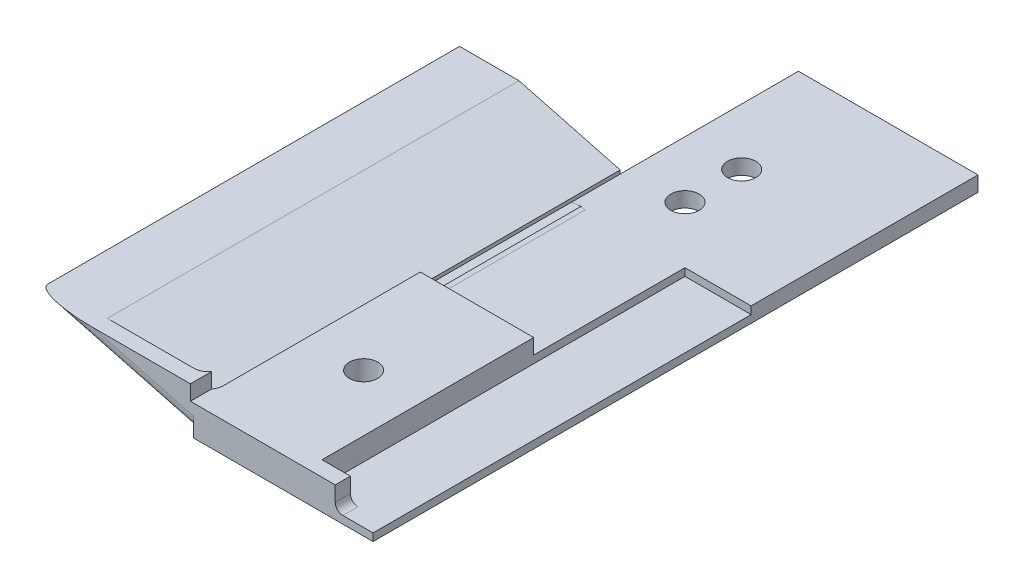
ISO-10303-21;
HEADER;
FILE_DESCRIPTION(('STEP AP214'),'2;1');
FILE_NAME('part.step','',(''),(''),'','','');
FILE_SCHEMA(('AUTOMOTIVE_DESIGN { 1 0 10303 214 1 1 1 1 }'));
ENDSEC;
DATA;
#1=APPLICATION_CONTEXT('core data for automotive mechanical design processes');
#2=APPLICATION_PROTOCOL_DEFINITION('international standard','automotive_design',2000,#1);
#3=PRODUCT_CONTEXT('',#1,'mechanical');
#4=PRODUCT('Part','Part','',(#3));
#5=PRODUCT_RELATED_PRODUCT_CATEGORY('part','',(#4));
#6=PRODUCT_DEFINITION_FORMATION('','',#4);
#7=PRODUCT_DEFINITION_CONTEXT('part definition',#1,'design');
#8=PRODUCT_DEFINITION('design','',#6,#7);
#9=PRODUCT_DEFINITION_SHAPE('','',#8);
#10=(LENGTH_UNIT() NAMED_UNIT(*) SI_UNIT(.MILLI.,.METRE.));
#11=(NAMED_UNIT(*) PLANE_ANGLE_UNIT() SI_UNIT($,.RADIAN.));
#12=(NAMED_UNIT(*) SI_UNIT($,.STERADIAN.) SOLID_ANGLE_UNIT());
#13=UNCERTAINTY_MEASURE_WITH_UNIT(LENGTH_MEASURE(1.E-05),#10,'distance_accuracy_value','');
#14=(GEOMETRIC_REPRESENTATION_CONTEXT(3) GLOBAL_UNCERTAINTY_ASSIGNED_CONTEXT((#13)) GLOBAL_UNIT_ASSIGNED_CONTEXT((#10,
#11,#12)) REPRESENTATION_CONTEXT('',''));
#15=CARTESIAN_POINT('',(0.,0.,0.));
#16=DIRECTION('',(0.,0.,1.));
#17=DIRECTION('',(1.,0.,0.));
#18=AXIS2_PLACEMENT_3D('',#15,#16,#17);
#19=CARTESIAN_POINT('',(-11.1125,5.08,0.));
#20=DIRECTION('',(-1.,0.,0.));
#21=DIRECTION('',(0.,0.,1.));
#22=AXIS2_PLACEMENT_3D('',#19,#20,#21);
#23=PLANE('',#22);
#24=DIRECTION('',(0.,0.,-1.));
#25=VECTOR('',#24,1.);
#26=CARTESIAN_POINT('',(-11.1125,5.08,0.));
#27=LINE('',#26,#25);
#28=CARTESIAN_POINT('',(-11.1125,5.08,48.26));
#29=VERTEX_POINT('',#28);
#30=CARTESIAN_POINT('',(-11.1125,5.08,12.7));
#31=VERTEX_POINT('',#30);
#32=EDGE_CURVE('E564',#29,#31,#27,.T.);
#33=ORIENTED_EDGE('',*,*,#32,.F.);
#34=DIRECTION('',(0.,1.,0.));
#35=VECTOR('',#34,1.);
#36=CARTESIAN_POINT('',(-11.1125,1.27,48.26));
#37=LINE('',#36,#35);
#38=CARTESIAN_POINT('',(-11.1125,1.27,48.26));
#39=VERTEX_POINT('',#38);
#40=EDGE_CURVE('E393',#39,#29,#37,.T.);
#41=ORIENTED_EDGE('',*,*,#40,.F.);
#42=DIRECTION('',(0.,0.,1.));
#43=VECTOR('',#42,1.);
#44=CARTESIAN_POINT('',(-11.1125,1.27,0.));
#45=LINE('',#44,#43);
#46=CARTESIAN_POINT('',(-11.1125,1.27,-12.7));
#47=VERTEX_POINT('',#46);
#48=EDGE_CURVE('E382',#47,#39,#45,.T.);
#49=ORIENTED_EDGE('',*,*,#48,.F.);
#50=DIRECTION('',(0.,1.,0.));
#51=VECTOR('',#50,1.);
#52=CARTESIAN_POINT('',(-11.1125,1.27,-12.7));
#53=LINE('',#52,#51);
#54=CARTESIAN_POINT('',(-11.1125,2.54,-12.7));
#55=VERTEX_POINT('',#54);
#56=EDGE_CURVE('E397',#47,#55,#53,.T.);
#57=ORIENTED_EDGE('',*,*,#56,.T.);
#58=DIRECTION('',(0.,0.,1.));
#59=VECTOR('',#58,1.);
#60=CARTESIAN_POINT('',(-11.1125,2.54,0.));
#61=LINE('',#60,#59);
#62=CARTESIAN_POINT('',(-11.1125,2.54,12.7));
#63=VERTEX_POINT('',#62);
#64=EDGE_CURVE('E381',#55,#63,#61,.T.);
#65=ORIENTED_EDGE('',*,*,#64,.T.);
#66=DIRECTION('',(0.,-1.,0.));
#67=VECTOR('',#66,1.);
#68=CARTESIAN_POINT('',(-11.1125,5.08,12.7));
#69=LINE('',#68,#67);
#70=EDGE_CURVE('E571',#31,#63,#69,.T.);
#71=ORIENTED_EDGE('',*,*,#70,.F.);
#72=EDGE_LOOP('',(#33,#41,#49,#57,#65,#71));
#73=FACE_BOUND('',#72,.T.);
#74=ADVANCED_FACE('F161',(#73),#23,.F.);
#75=CARTESIAN_POINT('',(0.,2.54,0.));
#76=DIRECTION('',(0.,-1.,0.));
#77=DIRECTION('',(0.,0.,-1.));
#78=AXIS2_PLACEMENT_3D('',#75,#76,#77);
#79=PLANE('',#78);
#80=CARTESIAN_POINT('',(-20.6375,2.54,-31.75));
#81=DIRECTION('',(0.,-1.,0.));
#82=DIRECTION('',(0.,0.,-1.));
#83=AXIS2_PLACEMENT_3D('',#80,#81,#82);
#84=CIRCLE('',#83,2.38125);
#85=CARTESIAN_POINT('',(-20.6375,2.54,-34.13125));
#86=VERTEX_POINT('',#85);
#87=EDGE_CURVE('E419',#86,#86,#84,.T.);
#88=ORIENTED_EDGE('',*,*,#87,.T.);
#89=EDGE_LOOP('',(#88));
#90=FACE_BOUND('',#89,.T.);
#91=CARTESIAN_POINT('',(-20.6375,2.54,-22.225));
#92=DIRECTION('',(0.,-1.,0.));
#93=DIRECTION('',(0.,0.,-1.));
#94=AXIS2_PLACEMENT_3D('',#91,#92,#93);
#95=CIRCLE('',#94,2.38125);
#96=CARTESIAN_POINT('',(-20.6375,2.54,-24.60625));
#97=VERTEX_POINT('',#96);
#98=EDGE_CURVE('E422',#97,#97,#95,.T.);
#99=ORIENTED_EDGE('',*,*,#98,.T.);
#100=EDGE_LOOP('',(#99));
#101=FACE_BOUND('',#100,.T.);
#102=DIRECTION('',(1.,0.,0.));
#103=VECTOR('',#102,1.);
#104=CARTESIAN_POINT('',(0.,2.54,12.7));
#105=LINE('',#104,#103);
#106=CARTESIAN_POINT('',(-27.8751566184035,2.54,12.7));
#107=VERTEX_POINT('',#106);
#108=EDGE_CURVE('E566',#107,#63,#105,.T.);
#109=ORIENTED_EDGE('',*,*,#108,.T.);
#110=ORIENTED_EDGE('',*,*,#64,.F.);
#111=DIRECTION('',(1.,0.,0.));
#112=VECTOR('',#111,1.);
#113=CARTESIAN_POINT('',(0.,2.54,-12.7));
#114=LINE('',#113,#112);
#115=CARTESIAN_POINT('',(0.,2.54,-12.7));
#116=VERTEX_POINT('',#115);
#117=EDGE_CURVE('E386',#55,#116,#114,.T.);
#118=ORIENTED_EDGE('',*,*,#117,.T.);
#119=DIRECTION('',(0.,0.,-1.));
#120=VECTOR('',#119,1.);
#121=CARTESIAN_POINT('',(0.,2.54,0.));
#122=LINE('',#121,#120);
#123=CARTESIAN_POINT('',(0.,2.54,-50.8));
#124=VERTEX_POINT('',#123);
#125=EDGE_CURVE('E406',#116,#124,#122,.T.);
#126=ORIENTED_EDGE('',*,*,#125,.T.);
#127=DIRECTION('',(-1.,0.,0.));
#128=VECTOR('',#127,1.);
#129=CARTESIAN_POINT('',(-30.1625,2.54,-50.8));
#130=LINE('',#129,#128);
#131=CARTESIAN_POINT('',(-30.1625,2.54,-50.8));
#132=VERTEX_POINT('',#131);
#133=EDGE_CURVE('E466',#124,#132,#130,.T.);
#134=ORIENTED_EDGE('',*,*,#133,.T.);
#135=DIRECTION('',(0.,0.,1.));
#136=VECTOR('',#135,1.);
#137=CARTESIAN_POINT('',(-30.1625,2.54,0.));
#138=LINE('',#137,#136);
#139=CARTESIAN_POINT('',(-30.1625,2.54,-20.8769227387817));
#140=VERTEX_POINT('',#139);
#141=EDGE_CURVE('E414',#132,#140,#138,.T.);
#142=ORIENTED_EDGE('',*,*,#141,.T.);
#143=CARTESIAN_POINT('',(-30.1625,2.54,-12.7));
#144=VERTEX_POINT('',#143);
#145=EDGE_CURVE('E413',#140,#144,#138,.T.);
#146=ORIENTED_EDGE('',*,*,#145,.T.);
#147=DIRECTION('',(1.,0.,0.));
#148=VECTOR('',#147,1.);
#149=CARTESIAN_POINT('',(0.,2.54,-12.7));
#150=LINE('',#149,#148);
#151=CARTESIAN_POINT('',(-27.8751566184035,2.54,-12.7));
#152=VERTEX_POINT('',#151);
#153=EDGE_CURVE('E410',#144,#152,#150,.T.);
#154=ORIENTED_EDGE('',*,*,#153,.T.);
#155=DIRECTION('',(0.,0.,-1.));
#156=VECTOR('',#155,1.);
#157=CARTESIAN_POINT('',(-27.8751566184035,2.54,0.));
#158=LINE('',#157,#156);
#159=EDGE_CURVE('E624',#107,#152,#158,.T.);
#160=ORIENTED_EDGE('',*,*,#159,.F.);
#161=EDGE_LOOP('',(#109,#110,#118,#126,#134,#142,#146,#154,#160));
#162=FACE_BOUND('',#161,.T.);
#163=ADVANCED_FACE('F581',(#90,#101,#162),#79,.F.);
#164=CARTESIAN_POINT('',(0.,7.62002500000001,-50.8));
#165=DIRECTION('',(-1.,0.,0.));
#166=DIRECTION('',(0.,0.,1.));
#167=AXIS2_PLACEMENT_3D('',#164,#165,#166);
#168=PLANE('',#167);
#169=DIRECTION('',(0.,0.,-1.));
#170=VECTOR('',#169,1.);
#171=CARTESIAN_POINT('',(0.,1.27,0.));
#172=LINE('',#171,#170);
#173=CARTESIAN_POINT('',(0.,1.27,50.8));
#174=VERTEX_POINT('',#173);
#175=CARTESIAN_POINT('',(0.,1.27,-12.7));
#176=VERTEX_POINT('',#175);
#177=EDGE_CURVE('E388',#174,#176,#172,.T.);
#178=ORIENTED_EDGE('',*,*,#177,.F.);
#179=DIRECTION('',(0.,-1.,0.));
#180=VECTOR('',#179,1.);
#181=CARTESIAN_POINT('',(0.,7.62002500000001,50.8));
#182=LINE('',#181,#180);
#183=CARTESIAN_POINT('',(0.,0.,50.8));
#184=VERTEX_POINT('',#183);
#185=EDGE_CURVE('E179',#174,#184,#182,.T.);
#186=ORIENTED_EDGE('',*,*,#185,.T.);
#187=DIRECTION('',(0.,0.,-1.));
#188=VECTOR('',#187,1.);
#189=CARTESIAN_POINT('',(0.,0.,-50.8));
#190=LINE('',#189,#188);
#191=CARTESIAN_POINT('',(0.,0.,-50.8));
#192=VERTEX_POINT('',#191);
#193=EDGE_CURVE('E399',#184,#192,#190,.T.);
#194=ORIENTED_EDGE('',*,*,#193,.T.);
#195=DIRECTION('',(0.,-1.,0.));
#196=VECTOR('',#195,1.);
#197=CARTESIAN_POINT('',(0.,7.62002500000001,-50.8));
#198=LINE('',#197,#196);
#199=EDGE_CURVE('E404',#124,#192,#198,.T.);
#200=ORIENTED_EDGE('',*,*,#199,.F.);
#201=ORIENTED_EDGE('',*,*,#125,.F.);
#202=DIRECTION('',(0.,1.,0.));
#203=VECTOR('',#202,1.);
#204=CARTESIAN_POINT('',(0.,1.27,-12.7));
#205=LINE('',#204,#203);
#206=EDGE_CURVE('E400',#176,#116,#205,.T.);
#207=ORIENTED_EDGE('',*,*,#206,.F.);
#208=EDGE_LOOP('',(#178,#186,#194,#200,#201,#207));
#209=FACE_BOUND('',#208,.T.);
#210=ADVANCED_FACE('F672',(#209),#168,.F.);
#211=CARTESIAN_POINT('',(-30.1625,2.54,50.8));
#212=DIRECTION('',(1.,0.,0.));
#213=DIRECTION('',(0.,0.,-1.));
#214=AXIS2_PLACEMENT_3D('',#211,#212,#213);
#215=PLANE('',#214);
#216=DIRECTION('',(0.,0.,1.));
#217=VECTOR('',#216,1.);
#218=CARTESIAN_POINT('',(-30.1625,3.14213795431633,-20.8769227387817));
#219=LINE('',#218,#217);
#220=CARTESIAN_POINT('',(-30.1625,3.14213795431633,12.7));
#221=VERTEX_POINT('',#220);
#222=CARTESIAN_POINT('',(-30.1625,3.14213795431633,45.72));
#223=VERTEX_POINT('',#222);
#224=EDGE_CURVE('E555',#221,#223,#219,.T.);
#225=ORIENTED_EDGE('',*,*,#224,.T.);
#226=DIRECTION('',(0.,1.,0.));
#227=VECTOR('',#226,1.);
#228=CARTESIAN_POINT('',(-30.1625,5.08,45.72));
#229=LINE('',#228,#227);
#230=CARTESIAN_POINT('',(-30.1625,5.08,45.72));
#231=VERTEX_POINT('',#230);
#232=EDGE_CURVE('E485',#223,#231,#229,.T.);
#233=ORIENTED_EDGE('',*,*,#232,.T.);
#234=DIRECTION('',(0.,0.,1.));
#235=VECTOR('',#234,1.);
#236=CARTESIAN_POINT('',(-30.1625,5.08,0.));
#237=LINE('',#236,#235);
#238=CARTESIAN_POINT('',(-30.1625,5.08,12.7));
#239=VERTEX_POINT('',#238);
#240=EDGE_CURVE('E553',#239,#231,#237,.T.);
#241=ORIENTED_EDGE('',*,*,#240,.F.);
#242=DIRECTION('',(0.,-1.,0.));
#243=VECTOR('',#242,1.);
#244=CARTESIAN_POINT('',(-30.1625,5.08,12.7));
#245=LINE('',#244,#243);
#246=EDGE_CURVE('E577',#239,#221,#245,.T.);
#247=ORIENTED_EDGE('',*,*,#246,.T.);
#248=EDGE_LOOP('',(#225,#233,#241,#247));
#249=FACE_BOUND('',#248,.T.);
#250=ADVANCED_FACE('F551',(#249),#215,.F.);
#251=DIRECTION('',(0.,-1.,0.));
#252=VECTOR('',#251,1.);
#253=CARTESIAN_POINT('',(-30.1625,0.,-20.8769227387817));
#254=LINE('',#253,#252);
#255=CARTESIAN_POINT('',(-30.1625,0.515601870336834,-20.8769227387817));
#256=VERTEX_POINT('',#255);
#257=EDGE_CURVE('E511',#140,#256,#254,.T.);
#258=ORIENTED_EDGE('',*,*,#257,.F.);
#259=ORIENTED_EDGE('',*,*,#141,.F.);
#260=DIRECTION('',(0.,-1.,0.));
#261=VECTOR('',#260,1.);
#262=CARTESIAN_POINT('',(-30.1625,2.54,-50.8));
#263=LINE('',#262,#261);
#264=CARTESIAN_POINT('',(-30.1625,0.,-50.8));
#265=VERTEX_POINT('',#264);
#266=EDGE_CURVE('E467',#132,#265,#263,.T.);
#267=ORIENTED_EDGE('',*,*,#266,.T.);
#268=DIRECTION('',(0.,0.,1.));
#269=VECTOR('',#268,1.);
#270=CARTESIAN_POINT('',(-30.1625,0.,50.8));
#271=LINE('',#270,#269);
#272=CARTESIAN_POINT('',(-30.1625,0.,50.8));
#273=VERTEX_POINT('',#272);
#274=EDGE_CURVE('E453',#265,#273,#271,.T.);
#275=ORIENTED_EDGE('',*,*,#274,.T.);
#276=DIRECTION('',(0.,-1.,0.));
#277=VECTOR('',#276,1.);
#278=CARTESIAN_POINT('',(-30.1625,2.54,50.8));
#279=LINE('',#278,#277);
#280=CARTESIAN_POINT('',(-30.1625,3.14213795431633,50.8));
#281=VERTEX_POINT('',#280);
#282=EDGE_CURVE('E532',#281,#273,#279,.T.);
#283=ORIENTED_EDGE('',*,*,#282,.F.);
#284=CARTESIAN_POINT('',(-30.1625,3.14213795431633,48.26));
#285=DIRECTION('',(1.,0.,0.));
#286=DIRECTION('',(0.,1.,0.));
#287=AXIS2_PLACEMENT_3D('',#284,#285,#286);
#288=ELLIPSE('',#287,2.62653608397949,2.54);
#289=CARTESIAN_POINT('',(-30.1625,0.515601870336837,48.26));
#290=VERTEX_POINT('',#289);
#291=EDGE_CURVE('E13',#281,#290,#288,.T.);
#292=ORIENTED_EDGE('',*,*,#291,.T.);
#293=DIRECTION('',(0.,0.,-1.));
#294=VECTOR('',#293,1.);
#295=CARTESIAN_POINT('',(-30.1625,0.515601870336832,50.8));
#296=LINE('',#295,#294);
#297=EDGE_CURVE('E498',#290,#256,#296,.T.);
#298=ORIENTED_EDGE('',*,*,#297,.T.);
#299=EDGE_LOOP('',(#258,#259,#267,#275,#283,#292,#298));
#300=FACE_BOUND('',#299,.T.);
#301=ADVANCED_FACE('F587',(#300),#215,.F.);
#302=CARTESIAN_POINT('',(-1.18122345318618,-4.48711732662614,-20.8769227387817));
#303=DIRECTION('',(-0.254574547751853,-0.967053152436276,0.));
#304=DIRECTION('',(0.967053152436276,-0.254574547751853,0.));
#305=AXIS2_PLACEMENT_3D('',#302,#303,#304);
#306=PLANE('',#305);
#307=DIRECTION('',(-0.967053152436276,0.254574547751853,0.));
#308=VECTOR('',#307,1.);
#309=CARTESIAN_POINT('',(-1.18122345318618,-4.48711732662614,48.26));
#310=LINE('',#309,#308);
#311=CARTESIAN_POINT('',(-32.7025,3.81078719004933,48.26));
#312=VERTEX_POINT('',#311);
#313=CARTESIAN_POINT('',(-47.1725689393118,7.62000000000001,48.26));
#314=VERTEX_POINT('',#313);
#315=EDGE_CURVE('E480',#312,#314,#310,.T.);
#316=ORIENTED_EDGE('',*,*,#315,.F.);
#317=CARTESIAN_POINT('',(-32.7025,3.81078719004932,45.72));
#318=DIRECTION('',(-0.254574547751853,-0.967053152436276,0.));
#319=DIRECTION('',(0.967053152436276,-0.254574547751853,0.));
#320=AXIS2_PLACEMENT_3D('',#317,#318,#319);
#321=ELLIPSE('',#320,2.62653608397949,2.54);
#322=EDGE_CURVE('E535',#312,#223,#321,.F.);
#323=ORIENTED_EDGE('',*,*,#322,.T.);
#324=ORIENTED_EDGE('',*,*,#224,.F.);
#325=CARTESIAN_POINT('',(-30.1625,3.14213795431633,-20.8769227387817));
#326=VERTEX_POINT('',#325);
#327=EDGE_CURVE('E165',#326,#221,#219,.T.);
#328=ORIENTED_EDGE('',*,*,#327,.F.);
#329=DIRECTION('',(0.967053152436276,-0.254574547751854,0.));
#330=VECTOR('',#329,1.);
#331=CARTESIAN_POINT('',(-1.18122345318618,-4.48711732662614,-20.8769227387817));
#332=LINE('',#331,#330);
#333=CARTESIAN_POINT('',(-47.1725689393118,7.62000000000001,-20.8769227387817));
#334=VERTEX_POINT('',#333);
#335=EDGE_CURVE('E447',#334,#326,#332,.T.);
#336=ORIENTED_EDGE('',*,*,#335,.F.);
#337=DIRECTION('',(0.,0.,1.));
#338=VECTOR('',#337,1.);
#339=CARTESIAN_POINT('',(-47.1725689393118,7.62000000000001,-20.8769227387817));
#340=LINE('',#339,#338);
#341=EDGE_CURVE('E544',#334,#314,#340,.T.);
#342=ORIENTED_EDGE('',*,*,#341,.T.);
#343=EDGE_LOOP('',(#316,#323,#324,#328,#336,#342));
#344=FACE_BOUND('',#343,.T.);
#345=ADVANCED_FACE('F542',(#344),#306,.F.);
#346=CARTESIAN_POINT('',(0.,5.08,12.7));
#347=DIRECTION('',(0.,0.,-1.));
#348=DIRECTION('',(-1.,0.,0.));
#349=AXIS2_PLACEMENT_3D('',#346,#347,#348);
#350=PLANE('',#349);
#351=DIRECTION('',(-0.967053152436276,0.254574547751853,0.));
#352=VECTOR('',#351,1.);
#353=CARTESIAN_POINT('',(-2.4318540173682,-4.1578916687818,12.7));
#354=LINE('',#353,#352);
#355=CARTESIAN_POINT('',(-28.5716689109964,2.72335528036258,12.7));
#356=VERTEX_POINT('',#355);
#357=EDGE_CURVE('E627',#107,#356,#354,.T.);
#358=ORIENTED_EDGE('',*,*,#357,.T.);
#359=DIRECTION('',(-0.994400982364481,-0.105672542661545,0.));
#360=VECTOR('',#359,1.);
#361=CARTESIAN_POINT('',(-0.0714125614798037,5.75200731145578,12.7));
#362=LINE('',#361,#360);
#363=CARTESIAN_POINT('',(-30.1625,2.55430157959057,12.7));
#364=VERTEX_POINT('',#363);
#365=EDGE_CURVE('E502',#356,#364,#362,.T.);
#366=ORIENTED_EDGE('',*,*,#365,.T.);
#367=DIRECTION('',(0.,1.,0.));
#368=VECTOR('',#367,1.);
#369=CARTESIAN_POINT('',(-30.1625,5.08,12.7));
#370=LINE('',#369,#368);
#371=EDGE_CURVE('E635',#364,#221,#370,.T.);
#372=ORIENTED_EDGE('',*,*,#371,.T.);
#373=ORIENTED_EDGE('',*,*,#246,.F.);
#374=DIRECTION('',(1.,0.,0.));
#375=VECTOR('',#374,1.);
#376=CARTESIAN_POINT('',(0.,5.08,12.7));
#377=LINE('',#376,#375);
#378=EDGE_CURVE('E560',#239,#31,#377,.T.);
#379=ORIENTED_EDGE('',*,*,#378,.T.);
#380=ORIENTED_EDGE('',*,*,#70,.T.);
#381=ORIENTED_EDGE('',*,*,#108,.F.);
#382=EDGE_LOOP('',(#358,#366,#372,#373,#379,#380,#381));
#383=FACE_BOUND('',#382,.T.);
#384=ADVANCED_FACE('F677',(#383),#350,.T.);
#385=CARTESIAN_POINT('',(-20.6375,5.08,-22.225));
#386=DIRECTION('',(0.,-1.,0.));
#387=DIRECTION('',(0.,0.,-1.));
#388=AXIS2_PLACEMENT_3D('',#385,#386,#387);
#389=CYLINDRICAL_SURFACE('',#388,2.38125);
#390=ORIENTED_EDGE('',*,*,#98,.F.);
#391=EDGE_LOOP('',(#390));
#392=FACE_BOUND('',#391,.T.);
#393=CARTESIAN_POINT('',(-20.6375,0.,-22.225));
#394=DIRECTION('',(0.,1.,0.));
#395=DIRECTION('',(0.,0.,1.));
#396=AXIS2_PLACEMENT_3D('',#393,#394,#395);
#397=CIRCLE('',#396,2.38125);
#398=CARTESIAN_POINT('',(-20.6375,0.,-19.84375));
#399=VERTEX_POINT('',#398);
#400=EDGE_CURVE('E642',#399,#399,#397,.T.);
#401=ORIENTED_EDGE('',*,*,#400,.F.);
#402=EDGE_LOOP('',(#401));
#403=FACE_BOUND('',#402,.T.);
#404=CARTESIAN_POINT('',(-20.6375,1.012198284899,-22.225));
#405=DIRECTION('',(0.105672542661545,-0.994400982364481,0.));
#406=DIRECTION('',(-0.994400982364481,-0.105672542661545,0.));
#407=AXIS2_PLACEMENT_3D('',#404,#405,#406);
#408=ELLIPSE('',#407,2.39465773086615,2.38125);
#409=CARTESIAN_POINT('',(-21.6590950414409,0.903635896572722,-20.0740246087406));
#410=VERTEX_POINT('',#409);
#411=CARTESIAN_POINT('',(-22.6004160094834,0.803604036269096,-20.8769227387817));
#412=VERTEX_POINT('',#411);
#413=EDGE_CURVE('E629',#410,#412,#408,.T.);
#414=ORIENTED_EDGE('',*,*,#413,.F.);
#415=CARTESIAN_POINT('',(-20.6375,0.634703320317564,-22.225));
#416=DIRECTION('',(-0.254574547751853,-0.967053152436276,0.));
#417=DIRECTION('',(0.967053152436276,-0.254574547751853,0.));
#418=AXIS2_PLACEMENT_3D('',#415,#416,#417);
#419=ELLIPSE('',#418,2.46237757873078,2.38125);
#420=CARTESIAN_POINT('',(-22.6004160094834,1.15143650517943,-20.8769227387817));
#421=VERTEX_POINT('',#420);
#422=EDGE_CURVE('E625',#410,#421,#419,.T.);
#423=ORIENTED_EDGE('',*,*,#422,.T.);
#424=DIRECTION('',(0.,-1.,0.));
#425=VECTOR('',#424,1.);
#426=CARTESIAN_POINT('',(-22.6004160094834,5.08,-20.8769227387817));
#427=LINE('',#426,#425);
#428=EDGE_CURVE('E474',#421,#412,#427,.T.);
#429=ORIENTED_EDGE('',*,*,#428,.T.);
#430=EDGE_LOOP('',(#414,#423,#429));
#431=FACE_BOUND('',#430,.T.);
#432=ADVANCED_FACE('F679',(#392,#403,#431),#389,.F.);
#433=CARTESIAN_POINT('',(-20.6375,5.08,31.75));
#434=DIRECTION('',(0.,-1.,0.));
#435=DIRECTION('',(0.,0.,-1.));
#436=AXIS2_PLACEMENT_3D('',#433,#434,#435);
#437=CYLINDRICAL_SURFACE('',#436,2.38125);
#438=CARTESIAN_POINT('',(-20.6375,5.08,31.75));
#439=DIRECTION('',(0.,1.,0.));
#440=DIRECTION('',(0.,0.,1.));
#441=AXIS2_PLACEMENT_3D('',#438,#439,#440);
#442=CIRCLE('',#441,2.38125);
#443=CARTESIAN_POINT('',(-20.6375,5.08,34.13125));
#444=VERTEX_POINT('',#443);
#445=EDGE_CURVE('E501',#444,#444,#442,.T.);
#446=ORIENTED_EDGE('',*,*,#445,.T.);
#447=EDGE_LOOP('',(#446));
#448=FACE_BOUND('',#447,.T.);
#449=CARTESIAN_POINT('',(-20.6375,0.,31.75));
#450=DIRECTION('',(0.,1.,0.));
#451=DIRECTION('',(0.,0.,1.));
#452=AXIS2_PLACEMENT_3D('',#449,#450,#451);
#453=CIRCLE('',#452,2.38125);
#454=CARTESIAN_POINT('',(-20.6375,0.,34.13125));
#455=VERTEX_POINT('',#454);
#456=EDGE_CURVE('E639',#455,#455,#453,.T.);
#457=ORIENTED_EDGE('',*,*,#456,.F.);
#458=EDGE_LOOP('',(#457));
#459=FACE_BOUND('',#458,.T.);
#460=CARTESIAN_POINT('',(-20.6375,1.012198284899,31.75));
#461=DIRECTION('',(0.105672542661545,-0.994400982364481,0.));
#462=DIRECTION('',(-0.994400982364481,-0.105672542661545,0.));
#463=AXIS2_PLACEMENT_3D('',#460,#461,#462);
#464=ELLIPSE('',#463,2.39465773086615,2.38125);
#465=CARTESIAN_POINT('',(-21.6590950414409,0.903635896572722,33.9009753912593));
#466=VERTEX_POINT('',#465);
#467=CARTESIAN_POINT('',(-21.6590950414409,0.903635896572722,29.5990246087406));
#468=VERTEX_POINT('',#467);
#469=EDGE_CURVE('E470',#466,#468,#464,.T.);
#470=ORIENTED_EDGE('',*,*,#469,.F.);
#471=CARTESIAN_POINT('',(-20.6375,0.634703320317564,31.75));
#472=DIRECTION('',(-0.254574547751853,-0.967053152436276,0.));
#473=DIRECTION('',(0.967053152436276,-0.254574547751853,0.));
#474=AXIS2_PLACEMENT_3D('',#471,#472,#473);
#475=ELLIPSE('',#474,2.46237757873078,2.38125);
#476=EDGE_CURVE('E473',#466,#468,#475,.T.);
#477=ORIENTED_EDGE('',*,*,#476,.T.);
#478=EDGE_LOOP('',(#470,#477));
#479=FACE_BOUND('',#478,.T.);
#480=ADVANCED_FACE('F689',(#448,#459,#479),#437,.F.);
#481=CARTESIAN_POINT('',(-30.1625,2.54,-50.8));
#482=DIRECTION('',(0.,0.,1.));
#483=DIRECTION('',(1.,0.,0.));
#484=AXIS2_PLACEMENT_3D('',#481,#482,#483);
#485=PLANE('',#484);
#486=ORIENTED_EDGE('',*,*,#133,.F.);
#487=ORIENTED_EDGE('',*,*,#199,.T.);
#488=DIRECTION('',(-1.,0.,0.));
#489=VECTOR('',#488,1.);
#490=CARTESIAN_POINT('',(-30.1625,0.,-50.8));
#491=LINE('',#490,#489);
#492=EDGE_CURVE('E457',#192,#265,#491,.T.);
#493=ORIENTED_EDGE('',*,*,#492,.T.);
#494=ORIENTED_EDGE('',*,*,#266,.F.);
#495=EDGE_LOOP('',(#486,#487,#493,#494));
#496=FACE_BOUND('',#495,.T.);
#497=ADVANCED_FACE('F589',(#496),#485,.F.);
#498=CARTESIAN_POINT('',(-30.1625,2.54,50.8));
#499=DIRECTION('',(0.,0.,-1.));
#500=DIRECTION('',(-1.,0.,0.));
#501=AXIS2_PLACEMENT_3D('',#498,#499,#500);
#502=PLANE('',#501);
#503=ORIENTED_EDGE('',*,*,#185,.F.);
#504=DIRECTION('',(1.,0.,0.));
#505=VECTOR('',#504,1.);
#506=CARTESIAN_POINT('',(5.08000000000001,1.27,50.8));
#507=LINE('',#506,#505);
#508=CARTESIAN_POINT('',(-5.07999999999999,1.27,50.8));
#509=VERTEX_POINT('',#508);
#510=EDGE_CURVE('E369',#509,#174,#507,.T.);
#511=ORIENTED_EDGE('',*,*,#510,.F.);
#512=CARTESIAN_POINT('',(-5.07999999999999,2.54,50.8));
#513=DIRECTION('',(0.,0.,1.));
#514=DIRECTION('',(1.,0.,0.));
#515=AXIS2_PLACEMENT_3D('',#512,#513,#514);
#516=CIRCLE('',#515,1.27);
#517=CARTESIAN_POINT('',(-6.35,2.54,50.8));
#518=VERTEX_POINT('',#517);
#519=EDGE_CURVE('E372',#518,#509,#516,.T.);
#520=ORIENTED_EDGE('',*,*,#519,.F.);
#521=DIRECTION('',(0.,-1.,0.));
#522=VECTOR('',#521,1.);
#523=CARTESIAN_POINT('',(-6.35,2.54,50.8));
#524=LINE('',#523,#522);
#525=CARTESIAN_POINT('',(-6.34999999999999,5.08,50.8));
#526=VERTEX_POINT('',#525);
#527=EDGE_CURVE('E352',#526,#518,#524,.T.);
#528=ORIENTED_EDGE('',*,*,#527,.F.);
#529=DIRECTION('',(1.,0.,0.));
#530=VECTOR('',#529,1.);
#531=CARTESIAN_POINT('',(0.,5.08,50.8));
#532=LINE('',#531,#530);
#533=CARTESIAN_POINT('',(-30.6705,5.08,50.8));
#534=VERTEX_POINT('',#533);
#535=EDGE_CURVE('E561',#534,#526,#532,.T.);
#536=ORIENTED_EDGE('',*,*,#535,.F.);
#537=DIRECTION('',(0.,1.,0.));
#538=VECTOR('',#537,1.);
#539=CARTESIAN_POINT('',(-30.6705,5.08,50.8));
#540=LINE('',#539,#538);
#541=CARTESIAN_POINT('',(-30.6705,7.62000000000001,50.8));
#542=VERTEX_POINT('',#541);
#543=EDGE_CURVE('E425',#534,#542,#540,.T.);
#544=ORIENTED_EDGE('',*,*,#543,.T.);
#545=DIRECTION('',(-1.,0.,0.));
#546=VECTOR('',#545,1.);
#547=CARTESIAN_POINT('',(0.,7.62,50.8));
#548=LINE('',#547,#546);
#549=CARTESIAN_POINT('',(-47.1725689393118,7.62,50.8));
#550=VERTEX_POINT('',#549);
#551=EDGE_CURVE('E437',#542,#550,#548,.T.);
#552=ORIENTED_EDGE('',*,*,#551,.T.);
#553=DIRECTION('',(0.967053152436276,-0.254574547751853,0.));
#554=VECTOR('',#553,1.);
#555=CARTESIAN_POINT('',(-30.0142613918263,3.10311447712679,50.8));
#556=LINE('',#555,#554);
#557=EDGE_CURVE('E529',#550,#281,#556,.T.);
#558=ORIENTED_EDGE('',*,*,#557,.T.);
#559=ORIENTED_EDGE('',*,*,#282,.T.);
#560=DIRECTION('',(1.,0.,0.));
#561=VECTOR('',#560,1.);
#562=CARTESIAN_POINT('',(-30.1625,0.,50.8));
#563=LINE('',#562,#561);
#564=EDGE_CURVE('E456',#273,#184,#563,.T.);
#565=ORIENTED_EDGE('',*,*,#564,.T.);
#566=EDGE_LOOP('',(#503,#511,#520,#528,#536,#544,#552,#558,#559,#565));
#567=FACE_BOUND('',#566,.T.);
#568=ADVANCED_FACE('F597',(#567),#502,.F.);
#569=CARTESIAN_POINT('',(0.,0.,0.));
#570=DIRECTION('',(0.,-1.,0.));
#571=DIRECTION('',(0.,0.,-1.));
#572=AXIS2_PLACEMENT_3D('',#569,#570,#571);
#573=PLANE('',#572);
#574=ORIENTED_EDGE('',*,*,#193,.F.);
#575=ORIENTED_EDGE('',*,*,#564,.F.);
#576=ORIENTED_EDGE('',*,*,#274,.F.);
#577=ORIENTED_EDGE('',*,*,#492,.F.);
#578=EDGE_LOOP('',(#574,#575,#576,#577));
#579=FACE_BOUND('',#578,.T.);
#580=ORIENTED_EDGE('',*,*,#400,.T.);
#581=EDGE_LOOP('',(#580));
#582=FACE_BOUND('',#581,.T.);
#583=ORIENTED_EDGE('',*,*,#456,.T.);
#584=EDGE_LOOP('',(#583));
#585=FACE_BOUND('',#584,.T.);
#586=CARTESIAN_POINT('',(-20.6375,0.,-31.75));
#587=DIRECTION('',(0.,1.,0.));
#588=DIRECTION('',(0.,0.,1.));
#589=AXIS2_PLACEMENT_3D('',#586,#587,#588);
#590=CIRCLE('',#589,2.38125);
#591=CARTESIAN_POINT('',(-20.6375,0.,-29.36875));
#592=VERTEX_POINT('',#591);
#593=EDGE_CURVE('E574',#592,#592,#590,.T.);
#594=ORIENTED_EDGE('',*,*,#593,.T.);
#595=EDGE_LOOP('',(#594));
#596=FACE_BOUND('',#595,.T.);
#597=ADVANCED_FACE('F592',(#579,#582,#585,#596),#573,.T.);
#598=CARTESIAN_POINT('',(0.,5.08,0.));
#599=DIRECTION('',(0.,1.,0.));
#600=DIRECTION('',(0.,0.,1.));
#601=AXIS2_PLACEMENT_3D('',#598,#599,#600);
#602=PLANE('',#601);
#603=DIRECTION('',(0.,0.,1.));
#604=VECTOR('',#603,1.);
#605=CARTESIAN_POINT('',(-6.34999999999999,5.08,0.));
#606=LINE('',#605,#604);
#607=CARTESIAN_POINT('',(-6.34999999999999,5.08,48.26));
#608=VERTEX_POINT('',#607);
#609=EDGE_CURVE('E377',#608,#526,#606,.T.);
#610=ORIENTED_EDGE('',*,*,#609,.F.);
#611=DIRECTION('',(-1.,0.,0.));
#612=VECTOR('',#611,1.);
#613=CARTESIAN_POINT('',(0.,5.08,48.26));
#614=LINE('',#613,#612);
#615=EDGE_CURVE('E368',#608,#29,#614,.T.);
#616=ORIENTED_EDGE('',*,*,#615,.T.);
#617=ORIENTED_EDGE('',*,*,#32,.T.);
#618=ORIENTED_EDGE('',*,*,#378,.F.);
#619=ORIENTED_EDGE('',*,*,#240,.T.);
#620=CARTESIAN_POINT('',(-32.7025,5.08,45.72));
#621=DIRECTION('',(0.,1.,0.));
#622=DIRECTION('',(0.,0.,1.));
#623=AXIS2_PLACEMENT_3D('',#620,#621,#622);
#624=CIRCLE('',#623,2.54);
#625=CARTESIAN_POINT('',(-30.6705,5.08,47.244));
#626=VERTEX_POINT('',#625);
#627=EDGE_CURVE('E522',#231,#626,#624,.F.);
#628=ORIENTED_EDGE('',*,*,#627,.T.);
#629=DIRECTION('',(0.,0.,1.));
#630=VECTOR('',#629,1.);
#631=CARTESIAN_POINT('',(-30.6705,5.08,48.26));
#632=LINE('',#631,#630);
#633=EDGE_CURVE('E428',#626,#534,#632,.T.);
#634=ORIENTED_EDGE('',*,*,#633,.T.);
#635=ORIENTED_EDGE('',*,*,#535,.T.);
#636=EDGE_LOOP('',(#610,#616,#617,#618,#619,#628,#634,#635));
#637=FACE_BOUND('',#636,.T.);
#638=ORIENTED_EDGE('',*,*,#445,.F.);
#639=EDGE_LOOP('',(#638));
#640=FACE_BOUND('',#639,.T.);
#641=ADVANCED_FACE('F557',(#637,#640),#602,.T.);
#642=CARTESIAN_POINT('',(-20.6375,5.08,-31.75));
#643=DIRECTION('',(0.,-1.,0.));
#644=DIRECTION('',(0.,0.,-1.));
#645=AXIS2_PLACEMENT_3D('',#642,#643,#644);
#646=CYLINDRICAL_SURFACE('',#645,2.38125);
#647=ORIENTED_EDGE('',*,*,#87,.F.);
#648=EDGE_LOOP('',(#647));
#649=FACE_BOUND('',#648,.T.);
#650=ORIENTED_EDGE('',*,*,#593,.F.);
#651=EDGE_LOOP('',(#650));
#652=FACE_BOUND('',#651,.T.);
#653=ADVANCED_FACE('F650',(#649,#652),#646,.F.);
#654=CARTESIAN_POINT('',(-0.33681517469597,3.16950204998541,-20.8769227387817));
#655=DIRECTION('',(0.105672542661545,-0.994400982364481,0.));
#656=DIRECTION('',(0.994400982364481,0.105672542661545,0.));
#657=AXIS2_PLACEMENT_3D('',#654,#655,#656);
#658=PLANE('',#657);
#659=DIRECTION('',(0.,0.,1.));
#660=VECTOR('',#659,1.);
#661=CARTESIAN_POINT('',(-21.6590950414409,0.903635896572722,-20.8769227387817));
#662=LINE('',#661,#660);
#663=EDGE_CURVE('E747',#468,#466,#662,.T.);
#664=ORIENTED_EDGE('',*,*,#663,.T.);
#665=ORIENTED_EDGE('',*,*,#469,.T.);
#666=EDGE_LOOP('',(#664,#665));
#667=FACE_BOUND('',#666,.T.);
#668=ADVANCED_FACE('F652',(#667),#658,.T.);
#669=CARTESIAN_POINT('',(-1.18122345318618,-4.48711732662614,-20.8769227387817));
#670=DIRECTION('',(-0.254574547751853,-0.967053152436276,0.));
#671=DIRECTION('',(0.967053152436276,-0.254574547751853,0.));
#672=AXIS2_PLACEMENT_3D('',#669,#670,#671);
#673=PLANE('',#672);
#674=ORIENTED_EDGE('',*,*,#476,.F.);
#675=ORIENTED_EDGE('',*,*,#663,.F.);
#676=EDGE_LOOP('',(#674,#675));
#677=FACE_BOUND('',#676,.T.);
#678=ADVANCED_FACE('F659',(#677),#673,.F.);
#679=CARTESIAN_POINT('',(0.,0.,-20.8769227387817));
#680=DIRECTION('',(0.,0.,1.));
#681=DIRECTION('',(1.,0.,0.));
#682=AXIS2_PLACEMENT_3D('',#679,#680,#681);
#683=PLANE('',#682);
#684=ORIENTED_EDGE('',*,*,#428,.F.);
#685=DIRECTION('',(0.967053152436276,-0.254574547751854,0.));
#686=VECTOR('',#685,1.);
#687=CARTESIAN_POINT('',(-1.18122345318618,-4.48711732662614,-20.8769227387817));
#688=LINE('',#687,#686);
#689=CARTESIAN_POINT('',(-21.6590950414409,0.903635896572722,-20.8769227387817));
#690=VERTEX_POINT('',#689);
#691=EDGE_CURVE('E743',#421,#690,#688,.T.);
#692=ORIENTED_EDGE('',*,*,#691,.T.);
#693=DIRECTION('',(0.994400982364481,0.105672542661545,0.));
#694=VECTOR('',#693,1.);
#695=CARTESIAN_POINT('',(-0.33681517469597,3.16950204998541,-20.8769227387817));
#696=LINE('',#695,#694);
#697=EDGE_CURVE('E452',#412,#690,#696,.T.);
#698=ORIENTED_EDGE('',*,*,#697,.F.);
#699=EDGE_LOOP('',(#684,#692,#698));
#700=FACE_BOUND('',#699,.T.);
#701=ADVANCED_FACE('F705',(#700),#683,.F.);
#702=EDGE_CURVE('E739',#690,#410,#662,.T.);
#703=ORIENTED_EDGE('',*,*,#702,.T.);
#704=ORIENTED_EDGE('',*,*,#413,.T.);
#705=ORIENTED_EDGE('',*,*,#697,.T.);
#706=EDGE_LOOP('',(#703,#704,#705));
#707=FACE_BOUND('',#706,.T.);
#708=ADVANCED_FACE('F662',(#707),#658,.T.);
#709=ORIENTED_EDGE('',*,*,#422,.F.);
#710=ORIENTED_EDGE('',*,*,#702,.F.);
#711=ORIENTED_EDGE('',*,*,#691,.F.);
#712=EDGE_LOOP('',(#709,#710,#711));
#713=FACE_BOUND('',#712,.T.);
#714=ADVANCED_FACE('F711',(#713),#673,.F.);
#715=CARTESIAN_POINT('',(-1.82784280447588,-6.94343233381428,-20.8769227387817));
#716=DIRECTION('',(-0.254574547751853,-0.967053152436276,0.));
#717=DIRECTION('',(0.967053152436276,-0.254574547751853,0.));
#718=AXIS2_PLACEMENT_3D('',#715,#716,#717);
#719=PLANE('',#718);
#720=DIRECTION('',(-0.967053152436276,0.254574547751853,0.));
#721=VECTOR('',#720,1.);
#722=CARTESIAN_POINT('',(-1.82784280447588,-6.94343233381428,48.26));
#723=LINE('',#722,#721);
#724=CARTESIAN_POINT('',(-54.6381316128598,6.95875634751055,48.26));
#725=VERTEX_POINT('',#724);
#726=EDGE_CURVE('E187',#290,#725,#723,.T.);
#727=ORIENTED_EDGE('',*,*,#726,.T.);
#728=DIRECTION('',(0.967053152436276,-0.254574547751853,0.));
#729=VECTOR('',#728,1.);
#730=CARTESIAN_POINT('',(-30.660880743116,0.646799469938648,48.26));
#731=LINE('',#730,#729);
#732=CARTESIAN_POINT('',(-57.15,7.62,48.26));
#733=VERTEX_POINT('',#732);
#734=EDGE_CURVE('E527',#725,#733,#731,.F.);
#735=ORIENTED_EDGE('',*,*,#734,.T.);
#736=DIRECTION('',(0.,0.,1.));
#737=VECTOR('',#736,1.);
#738=CARTESIAN_POINT('',(-57.15,7.62,-20.8769227387817));
#739=LINE('',#738,#737);
#740=CARTESIAN_POINT('',(-57.15,7.62,-20.8769227387817));
#741=VERTEX_POINT('',#740);
#742=EDGE_CURVE('E604',#741,#733,#739,.T.);
#743=ORIENTED_EDGE('',*,*,#742,.F.);
#744=DIRECTION('',(0.967053152436276,-0.254574547751853,0.));
#745=VECTOR('',#744,1.);
#746=CARTESIAN_POINT('',(-1.82784280447588,-6.94343233381428,-20.8769227387817));
#747=LINE('',#746,#745);
#748=EDGE_CURVE('E446',#741,#256,#747,.T.);
#749=ORIENTED_EDGE('',*,*,#748,.T.);
#750=ORIENTED_EDGE('',*,*,#297,.F.);
#751=EDGE_LOOP('',(#727,#735,#743,#749,#750));
#752=FACE_BOUND('',#751,.T.);
#753=ADVANCED_FACE('F602',(#752),#719,.T.);
#754=CARTESIAN_POINT('',(-0.605223433056294,5.69528054519119,-20.8769227387817));
#755=DIRECTION('',(0.105672542661545,-0.994400982364481,0.));
#756=DIRECTION('',(0.994400982364481,0.105672542661545,0.));
#757=AXIS2_PLACEMENT_3D('',#754,#755,#756);
#758=PLANE('',#757);
#759=ORIENTED_EDGE('',*,*,#365,.F.);
#760=DIRECTION('',(0.,0.,1.));
#761=VECTOR('',#760,1.);
#762=CARTESIAN_POINT('',(-28.5716689109964,2.72335528036258,-20.8769227387817));
#763=LINE('',#762,#761);
#764=CARTESIAN_POINT('',(-28.5716689109964,2.72335528036258,-12.7));
#765=VERTEX_POINT('',#764);
#766=EDGE_CURVE('E738',#765,#356,#763,.T.);
#767=ORIENTED_EDGE('',*,*,#766,.F.);
#768=DIRECTION('',(-0.994400982364481,-0.105672542661545,0.));
#769=VECTOR('',#768,1.);
#770=CARTESIAN_POINT('',(-0.0714125614798037,5.75200731145578,-12.7));
#771=LINE('',#770,#769);
#772=CARTESIAN_POINT('',(-30.1625,2.55430157959057,-12.7));
#773=VERTEX_POINT('',#772);
#774=EDGE_CURVE('E448',#765,#773,#771,.T.);
#775=ORIENTED_EDGE('',*,*,#774,.T.);
#776=DIRECTION('',(0.,0.,1.));
#777=VECTOR('',#776,1.);
#778=CARTESIAN_POINT('',(-30.1625,2.55430157959057,-20.8769227387817));
#779=LINE('',#778,#777);
#780=EDGE_CURVE('E742',#773,#364,#779,.T.);
#781=ORIENTED_EDGE('',*,*,#780,.T.);
#782=EDGE_LOOP('',(#759,#767,#775,#781));
#783=FACE_BOUND('',#782,.T.);
#784=ADVANCED_FACE('F717',(#783),#758,.F.);
#785=CARTESIAN_POINT('',(-30.1625,0.,-20.8769227387817));
#786=DIRECTION('',(-1.,0.,0.));
#787=DIRECTION('',(0.,0.,1.));
#788=AXIS2_PLACEMENT_3D('',#785,#786,#787);
#789=PLANE('',#788);
#790=ORIENTED_EDGE('',*,*,#371,.F.);
#791=ORIENTED_EDGE('',*,*,#780,.F.);
#792=DIRECTION('',(0.,1.,0.));
#793=VECTOR('',#792,1.);
#794=CARTESIAN_POINT('',(-30.1625,-40.057094971371,-12.7));
#795=LINE('',#794,#793);
#796=EDGE_CURVE('E417',#144,#773,#795,.T.);
#797=ORIENTED_EDGE('',*,*,#796,.F.);
#798=ORIENTED_EDGE('',*,*,#145,.F.);
#799=EDGE_CURVE('E458',#326,#140,#254,.T.);
#800=ORIENTED_EDGE('',*,*,#799,.F.);
#801=ORIENTED_EDGE('',*,*,#327,.T.);
#802=EDGE_LOOP('',(#790,#791,#797,#798,#800,#801));
#803=FACE_BOUND('',#802,.T.);
#804=ADVANCED_FACE('F612',(#803),#789,.F.);
#805=ORIENTED_EDGE('',*,*,#748,.F.);
#806=DIRECTION('',(-1.,0.,0.));
#807=VECTOR('',#806,1.);
#808=CARTESIAN_POINT('',(0.,7.62,-20.8769227387817));
#809=LINE('',#808,#807);
#810=EDGE_CURVE('E443',#334,#741,#809,.T.);
#811=ORIENTED_EDGE('',*,*,#810,.F.);
#812=ORIENTED_EDGE('',*,*,#335,.T.);
#813=ORIENTED_EDGE('',*,*,#799,.T.);
#814=ORIENTED_EDGE('',*,*,#257,.T.);
#815=EDGE_LOOP('',(#805,#811,#812,#813,#814));
#816=FACE_BOUND('',#815,.T.);
#817=ADVANCED_FACE('F605',(#816),#683,.F.);
#818=ORIENTED_EDGE('',*,*,#357,.F.);
#819=ORIENTED_EDGE('',*,*,#159,.T.);
#820=DIRECTION('',(-0.967053152436276,0.254574547751853,0.));
#821=VECTOR('',#820,1.);
#822=CARTESIAN_POINT('',(-2.4318540173682,-4.1578916687818,-12.7));
#823=LINE('',#822,#821);
#824=EDGE_CURVE('E621',#152,#765,#823,.T.);
#825=ORIENTED_EDGE('',*,*,#824,.T.);
#826=ORIENTED_EDGE('',*,*,#766,.T.);
#827=EDGE_LOOP('',(#818,#819,#825,#826));
#828=FACE_BOUND('',#827,.T.);
#829=ADVANCED_FACE('F709',(#828),#673,.F.);
#830=CARTESIAN_POINT('',(0.,7.62,-20.8769227387817));
#831=DIRECTION('',(0.,1.,0.));
#832=DIRECTION('',(0.,0.,1.));
#833=AXIS2_PLACEMENT_3D('',#830,#831,#832);
#834=PLANE('',#833);
#835=ORIENTED_EDGE('',*,*,#742,.T.);
#836=CARTESIAN_POINT('',(-47.1725689393118,7.62,48.26));
#837=DIRECTION('',(0.,1.,0.));
#838=DIRECTION('',(-1.,0.,0.));
#839=AXIS2_PLACEMENT_3D('',#836,#837,#838);
#840=ELLIPSE('',#839,9.97743106068823,2.54);
#841=EDGE_CURVE('E525',#733,#550,#840,.T.);
#842=ORIENTED_EDGE('',*,*,#841,.T.);
#843=ORIENTED_EDGE('',*,*,#551,.F.);
#844=DIRECTION('',(0.,0.,1.));
#845=VECTOR('',#844,1.);
#846=CARTESIAN_POINT('',(-30.6705,7.62000000000001,48.26));
#847=LINE('',#846,#845);
#848=CARTESIAN_POINT('',(-30.6705,7.62000000000001,47.244));
#849=VERTEX_POINT('',#848);
#850=EDGE_CURVE('E431',#849,#542,#847,.T.);
#851=ORIENTED_EDGE('',*,*,#850,.F.);
#852=CARTESIAN_POINT('',(-32.7025,7.62,45.72));
#853=DIRECTION('',(0.,1.,0.));
#854=DIRECTION('',(0.,0.,1.));
#855=AXIS2_PLACEMENT_3D('',#852,#853,#854);
#856=CIRCLE('',#855,2.54);
#857=CARTESIAN_POINT('',(-32.7025,7.62000000000001,48.26));
#858=VERTEX_POINT('',#857);
#859=EDGE_CURVE('E171',#849,#858,#856,.F.);
#860=ORIENTED_EDGE('',*,*,#859,.T.);
#861=DIRECTION('',(-1.,0.,0.));
#862=VECTOR('',#861,1.);
#863=CARTESIAN_POINT('',(-30.6705,7.62000000000001,48.26));
#864=LINE('',#863,#862);
#865=EDGE_CURVE('E426',#858,#314,#864,.T.);
#866=ORIENTED_EDGE('',*,*,#865,.T.);
#867=ORIENTED_EDGE('',*,*,#341,.F.);
#868=ORIENTED_EDGE('',*,*,#810,.T.);
#869=EDGE_LOOP('',(#835,#842,#843,#851,#860,#866,#867,#868));
#870=FACE_BOUND('',#869,.T.);
#871=ADVANCED_FACE('F607',(#870),#834,.T.);
#872=CARTESIAN_POINT('',(-30.6705,5.08,48.26));
#873=DIRECTION('',(1.,0.,0.));
#874=DIRECTION('',(0.,0.,-1.));
#875=AXIS2_PLACEMENT_3D('',#872,#873,#874);
#876=PLANE('',#875);
#877=ORIENTED_EDGE('',*,*,#543,.F.);
#878=ORIENTED_EDGE('',*,*,#633,.F.);
#879=DIRECTION('',(0.,-1.,0.));
#880=VECTOR('',#879,1.);
#881=CARTESIAN_POINT('',(-30.6705,5.08,47.244));
#882=LINE('',#881,#880);
#883=EDGE_CURVE('E519',#626,#849,#882,.F.);
#884=ORIENTED_EDGE('',*,*,#883,.T.);
#885=ORIENTED_EDGE('',*,*,#850,.T.);
#886=EDGE_LOOP('',(#877,#878,#884,#885));
#887=FACE_BOUND('',#886,.T.);
#888=ADVANCED_FACE('F695',(#887),#876,.T.);
#889=CARTESIAN_POINT('',(-43.702500098,-3.88600000000001,48.26));
#890=DIRECTION('',(0.,0.,1.));
#891=DIRECTION('',(1.,0.,0.));
#892=AXIS2_PLACEMENT_3D('',#889,#890,#891);
#893=PLANE('',#892);
#894=ORIENTED_EDGE('',*,*,#865,.F.);
#895=DIRECTION('',(0.,1.,0.));
#896=VECTOR('',#895,1.);
#897=CARTESIAN_POINT('',(-32.7025,3.14213795431633,48.26));
#898=LINE('',#897,#896);
#899=EDGE_CURVE('E492',#858,#312,#898,.F.);
#900=ORIENTED_EDGE('',*,*,#899,.T.);
#901=ORIENTED_EDGE('',*,*,#315,.T.);
#902=EDGE_LOOP('',(#894,#900,#901));
#903=FACE_BOUND('',#902,.T.);
#904=ADVANCED_FACE('F537',(#903),#893,.F.);
#905=CARTESIAN_POINT('',(-32.7025,2.54,45.72));
#906=DIRECTION('',(0.,-1.,0.));
#907=DIRECTION('',(0.,0.,-1.));
#908=AXIS2_PLACEMENT_3D('',#905,#906,#907);
#909=CYLINDRICAL_SURFACE('',#908,2.54);
#910=ORIENTED_EDGE('',*,*,#322,.F.);
#911=ORIENTED_EDGE('',*,*,#899,.F.);
#912=ORIENTED_EDGE('',*,*,#859,.F.);
#913=ORIENTED_EDGE('',*,*,#883,.F.);
#914=ORIENTED_EDGE('',*,*,#627,.F.);
#915=ORIENTED_EDGE('',*,*,#232,.F.);
#916=EDGE_LOOP('',(#910,#911,#912,#913,#914,#915));
#917=FACE_BOUND('',#916,.T.);
#918=ADVANCED_FACE('F546',(#917),#909,.F.);
#919=CARTESIAN_POINT('',(-30.0142613918263,3.10311447712679,48.26));
#920=DIRECTION('',(-0.967053152436276,0.254574547751853,0.));
#921=DIRECTION('',(-0.254574547751853,-0.967053152436276,0.));
#922=AXIS2_PLACEMENT_3D('',#919,#920,#921);
#923=CYLINDRICAL_SURFACE('',#922,2.54);
#924=ORIENTED_EDGE('',*,*,#734,.F.);
#925=ORIENTED_EDGE('',*,*,#726,.F.);
#926=ORIENTED_EDGE('',*,*,#291,.F.);
#927=ORIENTED_EDGE('',*,*,#557,.F.);
#928=ORIENTED_EDGE('',*,*,#841,.F.);
#929=EDGE_LOOP('',(#924,#925,#926,#927,#928));
#930=FACE_BOUND('',#929,.T.);
#931=ADVANCED_FACE('F163',(#930),#923,.T.);
#932=CARTESIAN_POINT('',(0.,-40.057094971371,-12.7));
#933=DIRECTION('',(0.,0.,1.));
#934=DIRECTION('',(1.,0.,0.));
#935=AXIS2_PLACEMENT_3D('',#932,#933,#934);
#936=PLANE('',#935);
#937=ORIENTED_EDGE('',*,*,#824,.F.);
#938=ORIENTED_EDGE('',*,*,#153,.F.);
#939=ORIENTED_EDGE('',*,*,#796,.T.);
#940=ORIENTED_EDGE('',*,*,#774,.F.);
#941=EDGE_LOOP('',(#937,#938,#939,#940));
#942=FACE_BOUND('',#941,.T.);
#943=ADVANCED_FACE('F619',(#942),#936,.F.);
#944=CARTESIAN_POINT('',(0.,1.27,-12.7));
#945=DIRECTION('',(0.,0.,1.));
#946=DIRECTION('',(1.,0.,0.));
#947=AXIS2_PLACEMENT_3D('',#944,#945,#946);
#948=PLANE('',#947);
#949=ORIENTED_EDGE('',*,*,#117,.F.);
#950=ORIENTED_EDGE('',*,*,#56,.F.);
#951=DIRECTION('',(1.,0.,0.));
#952=VECTOR('',#951,1.);
#953=CARTESIAN_POINT('',(0.,1.27,-12.7));
#954=LINE('',#953,#952);
#955=EDGE_CURVE('E391',#47,#176,#954,.T.);
#956=ORIENTED_EDGE('',*,*,#955,.T.);
#957=ORIENTED_EDGE('',*,*,#206,.T.);
#958=EDGE_LOOP('',(#949,#950,#956,#957));
#959=FACE_BOUND('',#958,.T.);
#960=ADVANCED_FACE('F885',(#959),#948,.T.);
#961=CARTESIAN_POINT('',(0.,1.27,48.26));
#962=DIRECTION('',(0.,0.,1.));
#963=DIRECTION('',(1.,0.,0.));
#964=AXIS2_PLACEMENT_3D('',#961,#962,#963);
#965=PLANE('',#964);
#966=DIRECTION('',(0.,-1.,0.));
#967=VECTOR('',#966,1.);
#968=CARTESIAN_POINT('',(-6.35,2.54,48.26));
#969=LINE('',#968,#967);
#970=CARTESIAN_POINT('',(-6.35,2.54,48.26));
#971=VERTEX_POINT('',#970);
#972=EDGE_CURVE('E349',#608,#971,#969,.T.);
#973=ORIENTED_EDGE('',*,*,#972,.T.);
#974=CARTESIAN_POINT('',(-5.07999999999999,2.54,48.26));
#975=DIRECTION('',(0.,0.,1.));
#976=DIRECTION('',(1.,0.,0.));
#977=AXIS2_PLACEMENT_3D('',#974,#975,#976);
#978=CIRCLE('',#977,1.27);
#979=CARTESIAN_POINT('',(-5.07999999999999,1.27,48.26));
#980=VERTEX_POINT('',#979);
#981=EDGE_CURVE('E357',#971,#980,#978,.T.);
#982=ORIENTED_EDGE('',*,*,#981,.T.);
#983=DIRECTION('',(1.,0.,0.));
#984=VECTOR('',#983,1.);
#985=CARTESIAN_POINT('',(0.,1.27,48.26));
#986=LINE('',#985,#984);
#987=EDGE_CURVE('E385',#39,#980,#986,.T.);
#988=ORIENTED_EDGE('',*,*,#987,.F.);
#989=ORIENTED_EDGE('',*,*,#40,.T.);
#990=ORIENTED_EDGE('',*,*,#615,.F.);
#991=EDGE_LOOP('',(#973,#982,#988,#989,#990));
#992=FACE_BOUND('',#991,.T.);
#993=ADVANCED_FACE('F366',(#992),#965,.F.);
#994=CARTESIAN_POINT('',(0.,1.27,0.));
#995=DIRECTION('',(0.,1.,0.));
#996=DIRECTION('',(0.,0.,1.));
#997=AXIS2_PLACEMENT_3D('',#994,#995,#996);
#998=PLANE('',#997);
#999=ORIENTED_EDGE('',*,*,#48,.T.);
#1000=ORIENTED_EDGE('',*,*,#987,.T.);
#1001=DIRECTION('',(0.,0.,1.));
#1002=VECTOR('',#1001,1.);
#1003=CARTESIAN_POINT('',(-5.07999999999999,1.27,48.26));
#1004=LINE('',#1003,#1002);
#1005=EDGE_CURVE('E356',#980,#509,#1004,.T.);
#1006=ORIENTED_EDGE('',*,*,#1005,.T.);
#1007=ORIENTED_EDGE('',*,*,#510,.T.);
#1008=ORIENTED_EDGE('',*,*,#177,.T.);
#1009=ORIENTED_EDGE('',*,*,#955,.F.);
#1010=EDGE_LOOP('',(#999,#1000,#1006,#1007,#1008,#1009));
#1011=FACE_BOUND('',#1010,.T.);
#1012=ADVANCED_FACE('F956',(#1011),#998,.T.);
#1013=CARTESIAN_POINT('',(-5.07999999999999,2.54,48.26));
#1014=DIRECTION('',(0.,0.,1.));
#1015=DIRECTION('',(1.,0.,0.));
#1016=AXIS2_PLACEMENT_3D('',#1013,#1014,#1015);
#1017=CYLINDRICAL_SURFACE('',#1016,1.27);
#1018=ORIENTED_EDGE('',*,*,#519,.T.);
#1019=ORIENTED_EDGE('',*,*,#1005,.F.);
#1020=ORIENTED_EDGE('',*,*,#981,.F.);
#1021=DIRECTION('',(0.,0.,1.));
#1022=VECTOR('',#1021,1.);
#1023=CARTESIAN_POINT('',(-6.35,2.54,48.26));
#1024=LINE('',#1023,#1022);
#1025=EDGE_CURVE('E345',#971,#518,#1024,.T.);
#1026=ORIENTED_EDGE('',*,*,#1025,.T.);
#1027=EDGE_LOOP('',(#1018,#1019,#1020,#1026));
#1028=FACE_BOUND('',#1027,.T.);
#1029=ADVANCED_FACE('F360',(#1028),#1017,.F.);
#1030=CARTESIAN_POINT('',(-6.35,2.54,48.26));
#1031=DIRECTION('',(-1.,0.,0.));
#1032=DIRECTION('',(0.,-1.,0.));
#1033=AXIS2_PLACEMENT_3D('',#1030,#1031,#1032);
#1034=PLANE('',#1033);
#1035=ORIENTED_EDGE('',*,*,#609,.T.);
#1036=ORIENTED_EDGE('',*,*,#527,.T.);
#1037=ORIENTED_EDGE('',*,*,#1025,.F.);
#1038=ORIENTED_EDGE('',*,*,#972,.F.);
#1039=EDGE_LOOP('',(#1035,#1036,#1037,#1038));
#1040=FACE_BOUND('',#1039,.T.);
#1041=ADVANCED_FACE('F347',(#1040),#1034,.F.);
#1042=CLOSED_SHELL('',(#74,#163,#210,#250,#301,#345,#384,#432,#480,#497,#568,#597,#641,#653,
#668,#678,#701,#708,#714,#753,#784,#804,#817,#829,#871,#888,#904,#918,#931,#943,#960,#993,#1012,
#1029,#1041));
#1043=MANIFOLD_SOLID_BREP('B2',#1042);
#1044=ADVANCED_BREP_SHAPE_REPRESENTATION('',(#18,#1043),#14);
#1045=SHAPE_DEFINITION_REPRESENTATION(#9,#1044);
ENDSEC;
END-ISO-10303-21;
